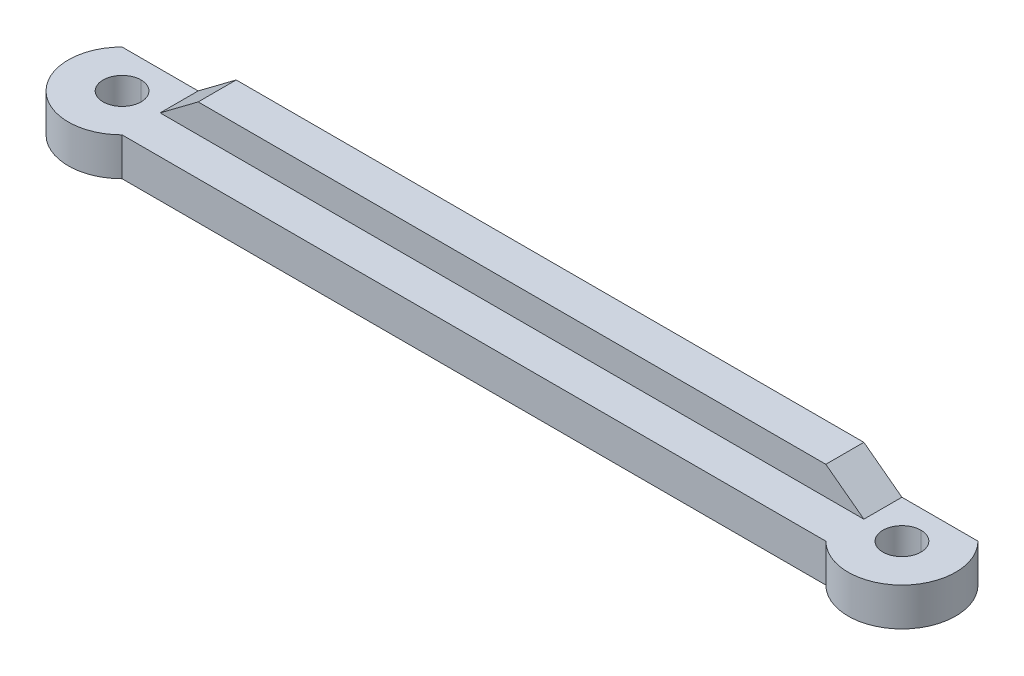
ISO-10303-21;
HEADER;
FILE_DESCRIPTION(('STEP AP214'),'2;1');
FILE_NAME('part.step','',(''),(''),'','','');
FILE_SCHEMA(('AUTOMOTIVE_DESIGN { 1 0 10303 214 1 1 1 1 }'));
ENDSEC;
DATA;
#1=APPLICATION_CONTEXT('core data for automotive mechanical design processes');
#2=APPLICATION_PROTOCOL_DEFINITION('international standard','automotive_design',2000,#1);
#3=PRODUCT_CONTEXT('',#1,'mechanical');
#4=PRODUCT('Part','Part','',(#3));
#5=PRODUCT_RELATED_PRODUCT_CATEGORY('part','',(#4));
#6=PRODUCT_DEFINITION_FORMATION('','',#4);
#7=PRODUCT_DEFINITION_CONTEXT('part definition',#1,'design');
#8=PRODUCT_DEFINITION('design','',#6,#7);
#9=PRODUCT_DEFINITION_SHAPE('','',#8);
#10=(LENGTH_UNIT() NAMED_UNIT(*) SI_UNIT(.MILLI.,.METRE.));
#11=(NAMED_UNIT(*) PLANE_ANGLE_UNIT() SI_UNIT($,.RADIAN.));
#12=(NAMED_UNIT(*) SI_UNIT($,.STERADIAN.) SOLID_ANGLE_UNIT());
#13=UNCERTAINTY_MEASURE_WITH_UNIT(LENGTH_MEASURE(1.E-05),#10,'distance_accuracy_value','');
#14=(GEOMETRIC_REPRESENTATION_CONTEXT(3) GLOBAL_UNCERTAINTY_ASSIGNED_CONTEXT((#13)) GLOBAL_UNIT_ASSIGNED_CONTEXT((#10,
#11,#12)) REPRESENTATION_CONTEXT('',''));
#15=CARTESIAN_POINT('',(0.,0.,0.));
#16=DIRECTION('',(0.,0.,1.));
#17=DIRECTION('',(1.,0.,0.));
#18=AXIS2_PLACEMENT_3D('',#15,#16,#17);
#19=CARTESIAN_POINT('',(0.,0.,-2.));
#20=DIRECTION('',(0.,0.,1.));
#21=DIRECTION('',(1.,0.,0.));
#22=AXIS2_PLACEMENT_3D('',#19,#20,#21);
#23=PLANE('',#22);
#24=DIRECTION('',(-1.,0.,0.));
#25=VECTOR('',#24,1.);
#26=CARTESIAN_POINT('',(41.,2.,-2.));
#27=LINE('',#26,#25);
#28=CARTESIAN_POINT('',(41.,2.,-2.));
#29=VERTEX_POINT('',#28);
#30=CARTESIAN_POINT('',(4.,2.,-2.));
#31=VERTEX_POINT('',#30);
#32=EDGE_CURVE('E196',#29,#31,#27,.T.);
#33=ORIENTED_EDGE('',*,*,#32,.F.);
#34=DIRECTION('',(0.8,-0.6,0.));
#35=VECTOR('',#34,1.);
#36=CARTESIAN_POINT('',(41.,2.,-2.));
#37=LINE('',#36,#35);
#38=CARTESIAN_POINT('',(39.,3.5,-2.));
#39=VERTEX_POINT('',#38);
#40=EDGE_CURVE('E160',#39,#29,#37,.T.);
#41=ORIENTED_EDGE('',*,*,#40,.F.);
#42=DIRECTION('',(1.,0.,0.));
#43=VECTOR('',#42,1.);
#44=CARTESIAN_POINT('',(39.,3.5,-2.));
#45=LINE('',#44,#43);
#46=CARTESIAN_POINT('',(6.,3.5,-2.));
#47=VERTEX_POINT('',#46);
#48=EDGE_CURVE('E25',#47,#39,#45,.T.);
#49=ORIENTED_EDGE('',*,*,#48,.F.);
#50=DIRECTION('',(0.8,0.6,0.));
#51=VECTOR('',#50,1.);
#52=CARTESIAN_POINT('',(6.,3.5,-2.));
#53=LINE('',#52,#51);
#54=EDGE_CURVE('E9',#31,#47,#53,.T.);
#55=ORIENTED_EDGE('',*,*,#54,.F.);
#56=EDGE_LOOP('',(#33,#41,#49,#55));
#57=FACE_BOUND('',#56,.T.);
#58=ADVANCED_FACE('F14',(#57),#23,.T.);
#59=CARTESIAN_POINT('',(6.,3.5,-2.));
#60=DIRECTION('',(-0.6,0.8,0.));
#61=DIRECTION('',(0.,0.,1.));
#62=AXIS2_PLACEMENT_3D('',#59,#60,#61);
#63=PLANE('',#62);
#64=DIRECTION('',(0.8,0.6,0.));
#65=VECTOR('',#64,1.);
#66=CARTESIAN_POINT('',(6.,3.5,-4.));
#67=LINE('',#66,#65);
#68=CARTESIAN_POINT('',(4.,2.,-4.));
#69=VERTEX_POINT('',#68);
#70=CARTESIAN_POINT('',(6.,3.5,-4.));
#71=VERTEX_POINT('',#70);
#72=EDGE_CURVE('E174',#69,#71,#67,.T.);
#73=ORIENTED_EDGE('',*,*,#72,.F.);
#74=DIRECTION('',(0.,0.,-1.));
#75=VECTOR('',#74,1.);
#76=CARTESIAN_POINT('',(4.,2.,-2.));
#77=LINE('',#76,#75);
#78=EDGE_CURVE('E193',#31,#69,#77,.T.);
#79=ORIENTED_EDGE('',*,*,#78,.F.);
#80=ORIENTED_EDGE('',*,*,#54,.T.);
#81=DIRECTION('',(0.,0.,-1.));
#82=VECTOR('',#81,1.);
#83=CARTESIAN_POINT('',(6.,3.5,-2.));
#84=LINE('',#83,#82);
#85=EDGE_CURVE('E159',#47,#71,#84,.T.);
#86=ORIENTED_EDGE('',*,*,#85,.T.);
#87=EDGE_LOOP('',(#73,#79,#80,#86));
#88=FACE_BOUND('',#87,.T.);
#89=ADVANCED_FACE('F313',(#88),#63,.T.);
#90=CARTESIAN_POINT('',(39.,3.5,-2.));
#91=DIRECTION('',(0.,1.,0.));
#92=DIRECTION('',(1.,0.,0.));
#93=AXIS2_PLACEMENT_3D('',#90,#91,#92);
#94=PLANE('',#93);
#95=DIRECTION('',(1.,0.,0.));
#96=VECTOR('',#95,1.);
#97=CARTESIAN_POINT('',(39.,3.5,-4.));
#98=LINE('',#97,#96);
#99=CARTESIAN_POINT('',(39.,3.5,-4.));
#100=VERTEX_POINT('',#99);
#101=EDGE_CURVE('E235',#71,#100,#98,.T.);
#102=ORIENTED_EDGE('',*,*,#101,.F.);
#103=ORIENTED_EDGE('',*,*,#85,.F.);
#104=ORIENTED_EDGE('',*,*,#48,.T.);
#105=DIRECTION('',(0.,0.,-1.));
#106=VECTOR('',#105,1.);
#107=CARTESIAN_POINT('',(39.,3.5,-2.));
#108=LINE('',#107,#106);
#109=EDGE_CURVE('E164',#39,#100,#108,.T.);
#110=ORIENTED_EDGE('',*,*,#109,.T.);
#111=EDGE_LOOP('',(#102,#103,#104,#110));
#112=FACE_BOUND('',#111,.T.);
#113=ADVANCED_FACE('F317',(#112),#94,.T.);
#114=CARTESIAN_POINT('',(41.,2.,-2.));
#115=DIRECTION('',(0.6,0.8,0.));
#116=DIRECTION('',(0.,0.,-1.));
#117=AXIS2_PLACEMENT_3D('',#114,#115,#116);
#118=PLANE('',#117);
#119=DIRECTION('',(0.8,-0.6,0.));
#120=VECTOR('',#119,1.);
#121=CARTESIAN_POINT('',(41.,2.,-4.));
#122=LINE('',#121,#120);
#123=CARTESIAN_POINT('',(41.,2.,-4.));
#124=VERTEX_POINT('',#123);
#125=EDGE_CURVE('E202',#100,#124,#122,.T.);
#126=ORIENTED_EDGE('',*,*,#125,.F.);
#127=ORIENTED_EDGE('',*,*,#109,.F.);
#128=ORIENTED_EDGE('',*,*,#40,.T.);
#129=DIRECTION('',(0.,0.,-1.));
#130=VECTOR('',#129,1.);
#131=CARTESIAN_POINT('',(41.,2.,-2.));
#132=LINE('',#131,#130);
#133=EDGE_CURVE('E187',#29,#124,#132,.T.);
#134=ORIENTED_EDGE('',*,*,#133,.T.);
#135=EDGE_LOOP('',(#126,#127,#128,#134));
#136=FACE_BOUND('',#135,.T.);
#137=ADVANCED_FACE('F307',(#136),#118,.T.);
#138=CARTESIAN_POINT('',(0.,0.,0.));
#139=DIRECTION('',(0.,1.,0.));
#140=DIRECTION('',(1.,0.,0.));
#141=AXIS2_PLACEMENT_3D('',#138,#139,#140);
#142=PLANE('',#141);
#143=CARTESIAN_POINT('',(43.,0.,-2.));
#144=DIRECTION('',(0.,1.,0.));
#145=DIRECTION('',(0.,0.,1.));
#146=AXIS2_PLACEMENT_3D('',#143,#144,#145);
#147=CIRCLE('',#146,1.);
#148=CARTESIAN_POINT('',(43.,0.,-3.));
#149=VERTEX_POINT('',#148);
#150=CARTESIAN_POINT('',(43.,0.,-1.));
#151=VERTEX_POINT('',#150);
#152=EDGE_CURVE('E175',#149,#151,#147,.T.);
#153=ORIENTED_EDGE('',*,*,#152,.T.);
#154=CARTESIAN_POINT('',(43.,0.,-2.));
#155=DIRECTION('',(0.,1.,0.));
#156=DIRECTION('',(0.,0.,1.));
#157=AXIS2_PLACEMENT_3D('',#154,#155,#156);
#158=CIRCLE('',#157,1.);
#159=EDGE_CURVE('E184',#151,#149,#158,.T.);
#160=ORIENTED_EDGE('',*,*,#159,.T.);
#161=EDGE_LOOP('',(#153,#160));
#162=FACE_BOUND('',#161,.T.);
#163=CARTESIAN_POINT('',(2.,0.,-2.));
#164=DIRECTION('',(0.,1.,0.));
#165=DIRECTION('',(0.,0.,1.));
#166=AXIS2_PLACEMENT_3D('',#163,#164,#165);
#167=CIRCLE('',#166,1.);
#168=CARTESIAN_POINT('',(2.,0.,-3.));
#169=VERTEX_POINT('',#168);
#170=CARTESIAN_POINT('',(2.,0.,-1.));
#171=VERTEX_POINT('',#170);
#172=EDGE_CURVE('E147',#169,#171,#167,.T.);
#173=ORIENTED_EDGE('',*,*,#172,.T.);
#174=CARTESIAN_POINT('',(2.,0.,-2.));
#175=DIRECTION('',(0.,1.,0.));
#176=DIRECTION('',(0.,0.,1.));
#177=AXIS2_PLACEMENT_3D('',#174,#175,#176);
#178=CIRCLE('',#177,1.);
#179=EDGE_CURVE('E192',#171,#169,#178,.T.);
#180=ORIENTED_EDGE('',*,*,#179,.T.);
#181=EDGE_LOOP('',(#173,#180));
#182=FACE_BOUND('',#181,.T.);
#183=DIRECTION('',(1.,0.,0.));
#184=VECTOR('',#183,1.);
#185=CARTESIAN_POINT('',(0.,0.,0.));
#186=LINE('',#185,#184);
#187=CARTESIAN_POINT('',(4.,0.,0.));
#188=VERTEX_POINT('',#187);
#189=CARTESIAN_POINT('',(41.,0.,0.));
#190=VERTEX_POINT('',#189);
#191=EDGE_CURVE('E18',#188,#190,#186,.T.);
#192=ORIENTED_EDGE('',*,*,#191,.F.);
#193=CARTESIAN_POINT('',(2.,0.,-2.));
#194=DIRECTION('',(0.,1.,0.));
#195=DIRECTION('',(0.,0.,1.));
#196=AXIS2_PLACEMENT_3D('',#193,#194,#195);
#197=CIRCLE('',#196,2.82842712474619);
#198=CARTESIAN_POINT('',(0.,0.,-4.));
#199=VERTEX_POINT('',#198);
#200=EDGE_CURVE('E113',#199,#188,#197,.T.);
#201=ORIENTED_EDGE('',*,*,#200,.F.);
#202=DIRECTION('',(1.,0.,0.));
#203=VECTOR('',#202,1.);
#204=CARTESIAN_POINT('',(0.,0.,-4.));
#205=LINE('',#204,#203);
#206=CARTESIAN_POINT('',(45.,0.,-4.));
#207=VERTEX_POINT('',#206);
#208=EDGE_CURVE('E81',#199,#207,#205,.T.);
#209=ORIENTED_EDGE('',*,*,#208,.T.);
#210=CARTESIAN_POINT('',(43.,0.,-2.));
#211=DIRECTION('',(0.,1.,0.));
#212=DIRECTION('',(0.,0.,1.));
#213=AXIS2_PLACEMENT_3D('',#210,#211,#212);
#214=CIRCLE('',#213,2.82842712474619);
#215=EDGE_CURVE('E171',#190,#207,#214,.T.);
#216=ORIENTED_EDGE('',*,*,#215,.F.);
#217=EDGE_LOOP('',(#192,#201,#209,#216));
#218=FACE_BOUND('',#217,.T.);
#219=ADVANCED_FACE('F114',(#162,#182,#218),#142,.F.);
#220=CARTESIAN_POINT('',(0.,2.,0.));
#221=DIRECTION('',(0.,1.,0.));
#222=DIRECTION('',(1.,0.,0.));
#223=AXIS2_PLACEMENT_3D('',#220,#221,#222);
#224=PLANE('',#223);
#225=CARTESIAN_POINT('',(43.,2.,-2.));
#226=DIRECTION('',(0.,1.,0.));
#227=DIRECTION('',(0.,0.,1.));
#228=AXIS2_PLACEMENT_3D('',#225,#226,#227);
#229=CIRCLE('',#228,1.);
#230=CARTESIAN_POINT('',(43.,2.,-3.));
#231=VERTEX_POINT('',#230);
#232=CARTESIAN_POINT('',(43.,2.,-1.));
#233=VERTEX_POINT('',#232);
#234=EDGE_CURVE('E203',#231,#233,#229,.T.);
#235=ORIENTED_EDGE('',*,*,#234,.F.);
#236=CARTESIAN_POINT('',(43.,2.,-2.));
#237=DIRECTION('',(0.,1.,0.));
#238=DIRECTION('',(0.,0.,1.));
#239=AXIS2_PLACEMENT_3D('',#236,#237,#238);
#240=CIRCLE('',#239,1.);
#241=EDGE_CURVE('E188',#233,#231,#240,.T.);
#242=ORIENTED_EDGE('',*,*,#241,.F.);
#243=EDGE_LOOP('',(#235,#242));
#244=FACE_BOUND('',#243,.T.);
#245=CARTESIAN_POINT('',(2.,2.,-2.));
#246=DIRECTION('',(0.,1.,0.));
#247=DIRECTION('',(0.,0.,1.));
#248=AXIS2_PLACEMENT_3D('',#245,#246,#247);
#249=CIRCLE('',#248,1.);
#250=CARTESIAN_POINT('',(2.,2.,-3.));
#251=VERTEX_POINT('',#250);
#252=CARTESIAN_POINT('',(2.,2.,-1.));
#253=VERTEX_POINT('',#252);
#254=EDGE_CURVE('E180',#251,#253,#249,.T.);
#255=ORIENTED_EDGE('',*,*,#254,.F.);
#256=CARTESIAN_POINT('',(2.,2.,-2.));
#257=DIRECTION('',(0.,1.,0.));
#258=DIRECTION('',(0.,0.,1.));
#259=AXIS2_PLACEMENT_3D('',#256,#257,#258);
#260=CIRCLE('',#259,1.);
#261=EDGE_CURVE('E215',#253,#251,#260,.T.);
#262=ORIENTED_EDGE('',*,*,#261,.F.);
#263=EDGE_LOOP('',(#255,#262));
#264=FACE_BOUND('',#263,.T.);
#265=ORIENTED_EDGE('',*,*,#133,.F.);
#266=ORIENTED_EDGE('',*,*,#32,.T.);
#267=ORIENTED_EDGE('',*,*,#78,.T.);
#268=DIRECTION('',(1.,0.,0.));
#269=VECTOR('',#268,1.);
#270=CARTESIAN_POINT('',(0.,2.,-4.));
#271=LINE('',#270,#269);
#272=CARTESIAN_POINT('',(0.,2.,-4.));
#273=VERTEX_POINT('',#272);
#274=EDGE_CURVE('E127',#273,#69,#271,.T.);
#275=ORIENTED_EDGE('',*,*,#274,.F.);
#276=CARTESIAN_POINT('',(2.,2.,-2.));
#277=DIRECTION('',(0.,1.,0.));
#278=DIRECTION('',(0.,0.,1.));
#279=AXIS2_PLACEMENT_3D('',#276,#277,#278);
#280=CIRCLE('',#279,2.82842712474619);
#281=CARTESIAN_POINT('',(4.,2.,0.));
#282=VERTEX_POINT('',#281);
#283=EDGE_CURVE('E96',#273,#282,#280,.T.);
#284=ORIENTED_EDGE('',*,*,#283,.T.);
#285=DIRECTION('',(1.,0.,0.));
#286=VECTOR('',#285,1.);
#287=CARTESIAN_POINT('',(0.,2.,0.));
#288=LINE('',#287,#286);
#289=CARTESIAN_POINT('',(41.,2.,0.));
#290=VERTEX_POINT('',#289);
#291=EDGE_CURVE('E155',#282,#290,#288,.T.);
#292=ORIENTED_EDGE('',*,*,#291,.T.);
#293=CARTESIAN_POINT('',(43.,2.,-2.));
#294=DIRECTION('',(0.,1.,0.));
#295=DIRECTION('',(0.,0.,1.));
#296=AXIS2_PLACEMENT_3D('',#293,#294,#295);
#297=CIRCLE('',#296,2.82842712474619);
#298=CARTESIAN_POINT('',(45.,2.,-4.));
#299=VERTEX_POINT('',#298);
#300=EDGE_CURVE('E134',#290,#299,#297,.T.);
#301=ORIENTED_EDGE('',*,*,#300,.T.);
#302=DIRECTION('',(1.,0.,0.));
#303=VECTOR('',#302,1.);
#304=CARTESIAN_POINT('',(0.,2.,-4.));
#305=LINE('',#304,#303);
#306=EDGE_CURVE('E119',#124,#299,#305,.T.);
#307=ORIENTED_EDGE('',*,*,#306,.F.);
#308=EDGE_LOOP('',(#265,#266,#267,#275,#284,#292,#301,#307));
#309=FACE_BOUND('',#308,.T.);
#310=ADVANCED_FACE('F250',(#244,#264,#309),#224,.T.);
#311=CARTESIAN_POINT('',(43.,2.,-2.));
#312=DIRECTION('',(0.,-1.,0.));
#313=DIRECTION('',(0.,0.,-1.));
#314=AXIS2_PLACEMENT_3D('',#311,#312,#313);
#315=CYLINDRICAL_SURFACE('',#314,1.);
#316=DIRECTION('',(0.,-1.,0.));
#317=VECTOR('',#316,1.);
#318=CARTESIAN_POINT('',(43.,2.,-1.));
#319=LINE('',#318,#317);
#320=EDGE_CURVE('E179',#233,#151,#319,.T.);
#321=ORIENTED_EDGE('',*,*,#320,.F.);
#322=ORIENTED_EDGE('',*,*,#241,.T.);
#323=DIRECTION('',(0.,-1.,0.));
#324=VECTOR('',#323,1.);
#325=CARTESIAN_POINT('',(43.,2.,-3.));
#326=LINE('',#325,#324);
#327=EDGE_CURVE('E145',#231,#149,#326,.T.);
#328=ORIENTED_EDGE('',*,*,#327,.T.);
#329=ORIENTED_EDGE('',*,*,#159,.F.);
#330=EDGE_LOOP('',(#321,#322,#328,#329));
#331=FACE_BOUND('',#330,.T.);
#332=ADVANCED_FACE('F16',(#331),#315,.F.);
#333=CARTESIAN_POINT('',(2.,2.,-2.));
#334=DIRECTION('',(0.,-1.,0.));
#335=DIRECTION('',(0.,0.,-1.));
#336=AXIS2_PLACEMENT_3D('',#333,#334,#335);
#337=CYLINDRICAL_SURFACE('',#336,1.);
#338=DIRECTION('',(0.,-1.,0.));
#339=VECTOR('',#338,1.);
#340=CARTESIAN_POINT('',(2.,2.,-1.));
#341=LINE('',#340,#339);
#342=EDGE_CURVE('E151',#253,#171,#341,.T.);
#343=ORIENTED_EDGE('',*,*,#342,.F.);
#344=ORIENTED_EDGE('',*,*,#261,.T.);
#345=DIRECTION('',(0.,-1.,0.));
#346=VECTOR('',#345,1.);
#347=CARTESIAN_POINT('',(2.,2.,-3.));
#348=LINE('',#347,#346);
#349=EDGE_CURVE('E150',#251,#169,#348,.T.);
#350=ORIENTED_EDGE('',*,*,#349,.T.);
#351=ORIENTED_EDGE('',*,*,#179,.F.);
#352=EDGE_LOOP('',(#343,#344,#350,#351));
#353=FACE_BOUND('',#352,.T.);
#354=ADVANCED_FACE('F293',(#353),#337,.F.);
#355=CARTESIAN_POINT('',(2.,2.,-2.));
#356=DIRECTION('',(0.,-1.,0.));
#357=DIRECTION('',(0.,0.,-1.));
#358=AXIS2_PLACEMENT_3D('',#355,#356,#357);
#359=CYLINDRICAL_SURFACE('',#358,2.82842712474619);
#360=ORIENTED_EDGE('',*,*,#200,.T.);
#361=DIRECTION('',(0.,-1.,0.));
#362=VECTOR('',#361,1.);
#363=CARTESIAN_POINT('',(4.,2.,0.));
#364=LINE('',#363,#362);
#365=EDGE_CURVE('E168',#282,#188,#364,.T.);
#366=ORIENTED_EDGE('',*,*,#365,.F.);
#367=ORIENTED_EDGE('',*,*,#283,.F.);
#368=DIRECTION('',(0.,-1.,0.));
#369=VECTOR('',#368,1.);
#370=CARTESIAN_POINT('',(0.,2.,-4.));
#371=LINE('',#370,#369);
#372=EDGE_CURVE('E122',#273,#199,#371,.T.);
#373=ORIENTED_EDGE('',*,*,#372,.T.);
#374=EDGE_LOOP('',(#360,#366,#367,#373));
#375=FACE_BOUND('',#374,.T.);
#376=ADVANCED_FACE('F123',(#375),#359,.T.);
#377=CARTESIAN_POINT('',(0.,2.,-4.));
#378=DIRECTION('',(0.,0.,-1.));
#379=DIRECTION('',(0.,-1.,0.));
#380=AXIS2_PLACEMENT_3D('',#377,#378,#379);
#381=PLANE('',#380);
#382=ORIENTED_EDGE('',*,*,#208,.F.);
#383=ORIENTED_EDGE('',*,*,#372,.F.);
#384=ORIENTED_EDGE('',*,*,#274,.T.);
#385=ORIENTED_EDGE('',*,*,#72,.T.);
#386=ORIENTED_EDGE('',*,*,#101,.T.);
#387=ORIENTED_EDGE('',*,*,#125,.T.);
#388=ORIENTED_EDGE('',*,*,#306,.T.);
#389=DIRECTION('',(0.,-1.,0.));
#390=VECTOR('',#389,1.);
#391=CARTESIAN_POINT('',(45.,2.,-4.));
#392=LINE('',#391,#390);
#393=EDGE_CURVE('E131',#299,#207,#392,.T.);
#394=ORIENTED_EDGE('',*,*,#393,.T.);
#395=EDGE_LOOP('',(#382,#383,#384,#385,#386,#387,#388,#394));
#396=FACE_BOUND('',#395,.T.);
#397=ADVANCED_FACE('F129',(#396),#381,.T.);
#398=CARTESIAN_POINT('',(43.,2.,-2.));
#399=DIRECTION('',(0.,-1.,0.));
#400=DIRECTION('',(0.,0.,-1.));
#401=AXIS2_PLACEMENT_3D('',#398,#399,#400);
#402=CYLINDRICAL_SURFACE('',#401,2.82842712474619);
#403=ORIENTED_EDGE('',*,*,#215,.T.);
#404=ORIENTED_EDGE('',*,*,#393,.F.);
#405=ORIENTED_EDGE('',*,*,#300,.F.);
#406=DIRECTION('',(0.,-1.,0.));
#407=VECTOR('',#406,1.);
#408=CARTESIAN_POINT('',(41.,2.,0.));
#409=LINE('',#408,#407);
#410=EDGE_CURVE('E152',#290,#190,#409,.T.);
#411=ORIENTED_EDGE('',*,*,#410,.T.);
#412=EDGE_LOOP('',(#403,#404,#405,#411));
#413=FACE_BOUND('',#412,.T.);
#414=ADVANCED_FACE('F322',(#413),#402,.T.);
#415=CARTESIAN_POINT('',(0.,2.,0.));
#416=DIRECTION('',(0.,0.,-1.));
#417=DIRECTION('',(0.,-1.,0.));
#418=AXIS2_PLACEMENT_3D('',#415,#416,#417);
#419=PLANE('',#418);
#420=ORIENTED_EDGE('',*,*,#191,.T.);
#421=ORIENTED_EDGE('',*,*,#410,.F.);
#422=ORIENTED_EDGE('',*,*,#291,.F.);
#423=ORIENTED_EDGE('',*,*,#365,.T.);
#424=EDGE_LOOP('',(#420,#421,#422,#423));
#425=FACE_BOUND('',#424,.T.);
#426=ADVANCED_FACE('F435',(#425),#419,.F.);
#427=CARTESIAN_POINT('',(2.,2.,-2.));
#428=DIRECTION('',(0.,-1.,0.));
#429=DIRECTION('',(0.,0.,-1.));
#430=AXIS2_PLACEMENT_3D('',#427,#428,#429);
#431=CYLINDRICAL_SURFACE('',#430,1.);
#432=ORIENTED_EDGE('',*,*,#254,.T.);
#433=ORIENTED_EDGE('',*,*,#342,.T.);
#434=ORIENTED_EDGE('',*,*,#172,.F.);
#435=ORIENTED_EDGE('',*,*,#349,.F.);
#436=EDGE_LOOP('',(#432,#433,#434,#435));
#437=FACE_BOUND('',#436,.T.);
#438=ADVANCED_FACE('F296',(#437),#431,.F.);
#439=CARTESIAN_POINT('',(43.,2.,-2.));
#440=DIRECTION('',(0.,-1.,0.));
#441=DIRECTION('',(0.,0.,-1.));
#442=AXIS2_PLACEMENT_3D('',#439,#440,#441);
#443=CYLINDRICAL_SURFACE('',#442,1.);
#444=ORIENTED_EDGE('',*,*,#234,.T.);
#445=ORIENTED_EDGE('',*,*,#320,.T.);
#446=ORIENTED_EDGE('',*,*,#152,.F.);
#447=ORIENTED_EDGE('',*,*,#327,.F.);
#448=EDGE_LOOP('',(#444,#445,#446,#447));
#449=FACE_BOUND('',#448,.T.);
#450=ADVANCED_FACE('F351',(#449),#443,.F.);
#451=CLOSED_SHELL('',(#58,#89,#113,#137,#219,#310,#332,#354,#376,#397,#414,#426,#438,#450));
#452=MANIFOLD_SOLID_BREP('B1',#451);
#453=ADVANCED_BREP_SHAPE_REPRESENTATION('',(#18,#452),#14);
#454=SHAPE_DEFINITION_REPRESENTATION(#9,#453);
ENDSEC;
END-ISO-10303-21;
